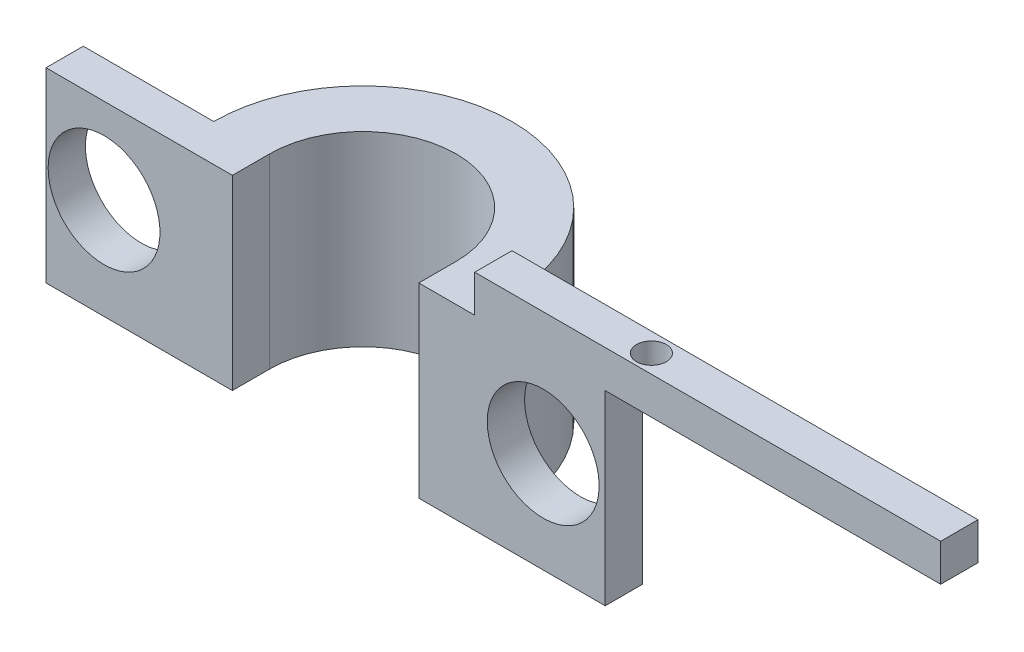
ISO-10303-21;
HEADER;
FILE_DESCRIPTION(('STEP AP214'),'2;1');
FILE_NAME('part.step','',(''),(''),'','','');
FILE_SCHEMA(('AUTOMOTIVE_DESIGN { 1 0 10303 214 1 1 1 1 }'));
ENDSEC;
DATA;
#1=APPLICATION_CONTEXT('core data for automotive mechanical design processes');
#2=APPLICATION_PROTOCOL_DEFINITION('international standard','automotive_design',2000,#1);
#3=PRODUCT_CONTEXT('',#1,'mechanical');
#4=PRODUCT('Part','Part','',(#3));
#5=PRODUCT_RELATED_PRODUCT_CATEGORY('part','',(#4));
#6=PRODUCT_DEFINITION_FORMATION('','',#4);
#7=PRODUCT_DEFINITION_CONTEXT('part definition',#1,'design');
#8=PRODUCT_DEFINITION('design','',#6,#7);
#9=PRODUCT_DEFINITION_SHAPE('','',#8);
#10=(LENGTH_UNIT() NAMED_UNIT(*) SI_UNIT(.MILLI.,.METRE.));
#11=(NAMED_UNIT(*) PLANE_ANGLE_UNIT() SI_UNIT($,.RADIAN.));
#12=(NAMED_UNIT(*) SI_UNIT($,.STERADIAN.) SOLID_ANGLE_UNIT());
#13=UNCERTAINTY_MEASURE_WITH_UNIT(LENGTH_MEASURE(1.E-05),#10,'distance_accuracy_value','');
#14=(GEOMETRIC_REPRESENTATION_CONTEXT(3) GLOBAL_UNCERTAINTY_ASSIGNED_CONTEXT((#13)) GLOBAL_UNIT_ASSIGNED_CONTEXT((#10,
#11,#12)) REPRESENTATION_CONTEXT('',''));
#15=CARTESIAN_POINT('',(0.,0.,0.));
#16=DIRECTION('',(0.,0.,1.));
#17=DIRECTION('',(1.,0.,0.));
#18=AXIS2_PLACEMENT_3D('',#15,#16,#17);
#19=CARTESIAN_POINT('',(0.,10.,0.));
#20=DIRECTION('',(0.,1.,0.));
#21=DIRECTION('',(0.,0.,1.));
#22=AXIS2_PLACEMENT_3D('',#19,#20,#21);
#23=PLANE('',#22);
#24=DIRECTION('',(0.,0.,1.));
#25=VECTOR('',#24,1.);
#26=CARTESIAN_POINT('',(8.,10.,0.));
#27=LINE('',#26,#25);
#28=CARTESIAN_POINT('',(8.,10.,0.));
#29=VERTEX_POINT('',#28);
#30=CARTESIAN_POINT('',(8.,10.,2.));
#31=VERTEX_POINT('',#30);
#32=EDGE_CURVE('E77',#29,#31,#27,.T.);
#33=ORIENTED_EDGE('',*,*,#32,.F.);
#34=CARTESIAN_POINT('',(0.,10.,0.));
#35=DIRECTION('',(0.,1.,0.));
#36=DIRECTION('',(1.,0.,0.));
#37=AXIS2_PLACEMENT_3D('',#34,#35,#36);
#38=CIRCLE('',#37,8.);
#39=CARTESIAN_POINT('',(-8.,10.,0.));
#40=VERTEX_POINT('',#39);
#41=EDGE_CURVE('E476',#29,#40,#38,.T.);
#42=ORIENTED_EDGE('',*,*,#41,.T.);
#43=DIRECTION('',(-1.,0.,0.));
#44=VECTOR('',#43,1.);
#45=CARTESIAN_POINT('',(-5.,10.,0.));
#46=LINE('',#45,#44);
#47=CARTESIAN_POINT('',(-15.,10.,0.));
#48=VERTEX_POINT('',#47);
#49=EDGE_CURVE('E212',#40,#48,#46,.T.);
#50=ORIENTED_EDGE('',*,*,#49,.T.);
#51=DIRECTION('',(0.,0.,-1.));
#52=VECTOR('',#51,1.);
#53=CARTESIAN_POINT('',(-15.,10.,2.));
#54=LINE('',#53,#52);
#55=CARTESIAN_POINT('',(-15.,10.,2.));
#56=VERTEX_POINT('',#55);
#57=EDGE_CURVE('E232',#56,#48,#54,.T.);
#58=ORIENTED_EDGE('',*,*,#57,.F.);
#59=DIRECTION('',(-1.,0.,0.));
#60=VECTOR('',#59,1.);
#61=CARTESIAN_POINT('',(-5.,10.,2.));
#62=LINE('',#61,#60);
#63=CARTESIAN_POINT('',(-5.,10.,2.));
#64=VERTEX_POINT('',#63);
#65=EDGE_CURVE('E218',#64,#56,#62,.T.);
#66=ORIENTED_EDGE('',*,*,#65,.F.);
#67=DIRECTION('',(0.,0.,-1.));
#68=VECTOR('',#67,1.);
#69=CARTESIAN_POINT('',(-5.,10.,2.));
#70=LINE('',#69,#68);
#71=CARTESIAN_POINT('',(-5.,10.,0.));
#72=VERTEX_POINT('',#71);
#73=EDGE_CURVE('E235',#64,#72,#70,.T.);
#74=ORIENTED_EDGE('',*,*,#73,.T.);
#75=CARTESIAN_POINT('',(0.,10.,0.));
#76=DIRECTION('',(0.,1.,0.));
#77=DIRECTION('',(0.,0.,1.));
#78=AXIS2_PLACEMENT_3D('',#75,#76,#77);
#79=CIRCLE('',#78,5.);
#80=CARTESIAN_POINT('',(5.,10.,0.));
#81=VERTEX_POINT('',#80);
#82=EDGE_CURVE('E103',#81,#72,#79,.T.);
#83=ORIENTED_EDGE('',*,*,#82,.F.);
#84=DIRECTION('',(0.,0.,-1.));
#85=VECTOR('',#84,1.);
#86=CARTESIAN_POINT('',(5.,10.,2.));
#87=LINE('',#86,#85);
#88=CARTESIAN_POINT('',(5.,10.,2.));
#89=VERTEX_POINT('',#88);
#90=EDGE_CURVE('E244',#89,#81,#87,.T.);
#91=ORIENTED_EDGE('',*,*,#90,.F.);
#92=DIRECTION('',(-1.,0.,0.));
#93=VECTOR('',#92,1.);
#94=CARTESIAN_POINT('',(5.,10.,2.));
#95=LINE('',#94,#93);
#96=EDGE_CURVE('E85',#31,#89,#95,.T.);
#97=ORIENTED_EDGE('',*,*,#96,.F.);
#98=EDGE_LOOP('',(#33,#42,#50,#58,#66,#74,#83,#91,#97));
#99=FACE_BOUND('',#98,.T.);
#100=ADVANCED_FACE('F39',(#99),#23,.T.);
#101=CARTESIAN_POINT('',(0.,0.,0.));
#102=DIRECTION('',(0.,1.,0.));
#103=DIRECTION('',(0.,0.,1.));
#104=AXIS2_PLACEMENT_3D('',#101,#102,#103);
#105=PLANE('',#104);
#106=CARTESIAN_POINT('',(0.,0.,0.));
#107=DIRECTION('',(0.,1.,0.));
#108=DIRECTION('',(1.,0.,0.));
#109=AXIS2_PLACEMENT_3D('',#106,#107,#108);
#110=CIRCLE('',#109,8.);
#111=CARTESIAN_POINT('',(8.,0.,0.));
#112=VERTEX_POINT('',#111);
#113=CARTESIAN_POINT('',(-8.,0.,0.));
#114=VERTEX_POINT('',#113);
#115=EDGE_CURVE('E481',#112,#114,#110,.T.);
#116=ORIENTED_EDGE('',*,*,#115,.F.);
#117=DIRECTION('',(1.,0.,0.));
#118=VECTOR('',#117,1.);
#119=CARTESIAN_POINT('',(5.,0.,0.));
#120=LINE('',#119,#118);
#121=CARTESIAN_POINT('',(15.,0.,0.));
#122=VERTEX_POINT('',#121);
#123=EDGE_CURVE('E237',#112,#122,#120,.T.);
#124=ORIENTED_EDGE('',*,*,#123,.T.);
#125=DIRECTION('',(0.,0.,-1.));
#126=VECTOR('',#125,1.);
#127=CARTESIAN_POINT('',(15.,0.,2.));
#128=LINE('',#127,#126);
#129=CARTESIAN_POINT('',(15.,0.,2.));
#130=VERTEX_POINT('',#129);
#131=EDGE_CURVE('E250',#130,#122,#128,.T.);
#132=ORIENTED_EDGE('',*,*,#131,.F.);
#133=DIRECTION('',(1.,0.,0.));
#134=VECTOR('',#133,1.);
#135=CARTESIAN_POINT('',(5.,0.,2.));
#136=LINE('',#135,#134);
#137=CARTESIAN_POINT('',(5.,0.,2.));
#138=VERTEX_POINT('',#137);
#139=EDGE_CURVE('E108',#138,#130,#136,.T.);
#140=ORIENTED_EDGE('',*,*,#139,.F.);
#141=DIRECTION('',(0.,0.,-1.));
#142=VECTOR('',#141,1.);
#143=CARTESIAN_POINT('',(5.,0.,2.));
#144=LINE('',#143,#142);
#145=CARTESIAN_POINT('',(5.,0.,0.));
#146=VERTEX_POINT('',#145);
#147=EDGE_CURVE('E483',#138,#146,#144,.T.);
#148=ORIENTED_EDGE('',*,*,#147,.T.);
#149=CARTESIAN_POINT('',(0.,0.,0.));
#150=DIRECTION('',(0.,1.,0.));
#151=DIRECTION('',(0.,0.,1.));
#152=AXIS2_PLACEMENT_3D('',#149,#150,#151);
#153=CIRCLE('',#152,5.);
#154=CARTESIAN_POINT('',(-5.,0.,0.));
#155=VERTEX_POINT('',#154);
#156=EDGE_CURVE('E56',#146,#155,#153,.T.);
#157=ORIENTED_EDGE('',*,*,#156,.T.);
#158=DIRECTION('',(0.,0.,-1.));
#159=VECTOR('',#158,1.);
#160=CARTESIAN_POINT('',(-5.,0.,2.));
#161=LINE('',#160,#159);
#162=CARTESIAN_POINT('',(-5.,0.,2.));
#163=VERTEX_POINT('',#162);
#164=EDGE_CURVE('E224',#163,#155,#161,.T.);
#165=ORIENTED_EDGE('',*,*,#164,.F.);
#166=DIRECTION('',(1.,0.,0.));
#167=VECTOR('',#166,1.);
#168=CARTESIAN_POINT('',(-5.,0.,2.));
#169=LINE('',#168,#167);
#170=CARTESIAN_POINT('',(-15.,0.,2.));
#171=VERTEX_POINT('',#170);
#172=EDGE_CURVE('E222',#171,#163,#169,.T.);
#173=ORIENTED_EDGE('',*,*,#172,.F.);
#174=DIRECTION('',(0.,0.,-1.));
#175=VECTOR('',#174,1.);
#176=CARTESIAN_POINT('',(-15.,0.,2.));
#177=LINE('',#176,#175);
#178=CARTESIAN_POINT('',(-15.,0.,0.));
#179=VERTEX_POINT('',#178);
#180=EDGE_CURVE('E230',#171,#179,#177,.T.);
#181=ORIENTED_EDGE('',*,*,#180,.T.);
#182=DIRECTION('',(1.,0.,0.));
#183=VECTOR('',#182,1.);
#184=CARTESIAN_POINT('',(-5.,0.,0.));
#185=LINE('',#184,#183);
#186=EDGE_CURVE('E65',#179,#114,#185,.T.);
#187=ORIENTED_EDGE('',*,*,#186,.T.);
#188=EDGE_LOOP('',(#116,#124,#132,#140,#148,#157,#165,#173,#181,#187));
#189=FACE_BOUND('',#188,.T.);
#190=ADVANCED_FACE('F300',(#189),#105,.F.);
#191=CARTESIAN_POINT('',(0.,10.,0.));
#192=DIRECTION('',(0.,-1.,0.));
#193=DIRECTION('',(0.,0.,-1.));
#194=AXIS2_PLACEMENT_3D('',#191,#192,#193);
#195=CYLINDRICAL_SURFACE('',#194,8.);
#196=ORIENTED_EDGE('',*,*,#41,.F.);
#197=DIRECTION('',(0.,1.,0.));
#198=VECTOR('',#197,1.);
#199=CARTESIAN_POINT('',(8.,0.,0.));
#200=LINE('',#199,#198);
#201=EDGE_CURVE('E479',#112,#29,#200,.T.);
#202=ORIENTED_EDGE('',*,*,#201,.F.);
#203=ORIENTED_EDGE('',*,*,#115,.T.);
#204=DIRECTION('',(0.,1.,0.));
#205=VECTOR('',#204,1.);
#206=CARTESIAN_POINT('',(-8.,0.,0.));
#207=LINE('',#206,#205);
#208=EDGE_CURVE('E480',#114,#40,#207,.T.);
#209=ORIENTED_EDGE('',*,*,#208,.T.);
#210=EDGE_LOOP('',(#196,#202,#203,#209));
#211=FACE_BOUND('',#210,.T.);
#212=ADVANCED_FACE('F41',(#211),#195,.T.);
#213=CARTESIAN_POINT('',(0.,10.,0.));
#214=DIRECTION('',(0.,-1.,0.));
#215=DIRECTION('',(0.,0.,-1.));
#216=AXIS2_PLACEMENT_3D('',#213,#214,#215);
#217=CYLINDRICAL_SURFACE('',#216,5.);
#218=DIRECTION('',(0.,-1.,0.));
#219=VECTOR('',#218,1.);
#220=CARTESIAN_POINT('',(5.,10.,0.));
#221=LINE('',#220,#219);
#222=EDGE_CURVE('E12',#81,#146,#221,.T.);
#223=ORIENTED_EDGE('',*,*,#222,.F.);
#224=ORIENTED_EDGE('',*,*,#82,.T.);
#225=DIRECTION('',(0.,-1.,0.));
#226=VECTOR('',#225,1.);
#227=CARTESIAN_POINT('',(-5.,10.,0.));
#228=LINE('',#227,#226);
#229=EDGE_CURVE('E48',#155,#72,#228,.F.);
#230=ORIENTED_EDGE('',*,*,#229,.F.);
#231=ORIENTED_EDGE('',*,*,#156,.F.);
#232=EDGE_LOOP('',(#223,#224,#230,#231));
#233=FACE_BOUND('',#232,.T.);
#234=ADVANCED_FACE('F308',(#233),#217,.F.);
#235=CARTESIAN_POINT('',(0.,0.,0.));
#236=DIRECTION('',(0.,0.,1.));
#237=DIRECTION('',(1.,0.,0.));
#238=AXIS2_PLACEMENT_3D('',#235,#236,#237);
#239=PLANE('',#238);
#240=CARTESIAN_POINT('',(11.6742620763688,5.40681404768861,0.));
#241=DIRECTION('',(0.,0.,-1.));
#242=DIRECTION('',(-1.,0.,0.));
#243=AXIS2_PLACEMENT_3D('',#240,#241,#242);
#244=CIRCLE('',#243,3.);
#245=CARTESIAN_POINT('',(8.67426207636879,5.40681404768861,0.));
#246=VERTEX_POINT('',#245);
#247=EDGE_CURVE('E207',#246,#246,#244,.T.);
#248=ORIENTED_EDGE('',*,*,#247,.F.);
#249=EDGE_LOOP('',(#248));
#250=FACE_BOUND('',#249,.T.);
#251=ORIENTED_EDGE('',*,*,#123,.F.);
#252=ORIENTED_EDGE('',*,*,#201,.T.);
#253=DIRECTION('',(0.,-1.,0.));
#254=VECTOR('',#253,1.);
#255=CARTESIAN_POINT('',(8.,12.,0.));
#256=LINE('',#255,#254);
#257=CARTESIAN_POINT('',(8.,12.,0.));
#258=VERTEX_POINT('',#257);
#259=EDGE_CURVE('E273',#258,#29,#256,.T.);
#260=ORIENTED_EDGE('',*,*,#259,.F.);
#261=DIRECTION('',(-1.,0.,0.));
#262=VECTOR('',#261,1.);
#263=CARTESIAN_POINT('',(8.,12.,0.));
#264=LINE('',#263,#262);
#265=CARTESIAN_POINT('',(33.,12.,0.));
#266=VERTEX_POINT('',#265);
#267=EDGE_CURVE('E170',#266,#258,#264,.T.);
#268=ORIENTED_EDGE('',*,*,#267,.F.);
#269=DIRECTION('',(0.,-1.,0.));
#270=VECTOR('',#269,1.);
#271=CARTESIAN_POINT('',(33.,12.,0.));
#272=LINE('',#271,#270);
#273=CARTESIAN_POINT('',(33.,10.,0.));
#274=VERTEX_POINT('',#273);
#275=EDGE_CURVE('E182',#266,#274,#272,.T.);
#276=ORIENTED_EDGE('',*,*,#275,.T.);
#277=DIRECTION('',(-1.,0.,0.));
#278=VECTOR('',#277,1.);
#279=CARTESIAN_POINT('',(8.,10.,0.));
#280=LINE('',#279,#278);
#281=CARTESIAN_POINT('',(15.,10.,0.));
#282=VERTEX_POINT('',#281);
#283=EDGE_CURVE('E174',#274,#282,#280,.T.);
#284=ORIENTED_EDGE('',*,*,#283,.T.);
#285=DIRECTION('',(0.,1.,0.));
#286=VECTOR('',#285,1.);
#287=CARTESIAN_POINT('',(15.,10.,0.));
#288=LINE('',#287,#286);
#289=EDGE_CURVE('E193',#122,#282,#288,.T.);
#290=ORIENTED_EDGE('',*,*,#289,.F.);
#291=EDGE_LOOP('',(#251,#252,#260,#268,#276,#284,#290));
#292=FACE_BOUND('',#291,.T.);
#293=ADVANCED_FACE('F272',(#250,#292),#239,.F.);
#294=CARTESIAN_POINT('',(5.,10.,2.));
#295=DIRECTION('',(1.,0.,0.));
#296=DIRECTION('',(0.,0.,-1.));
#297=AXIS2_PLACEMENT_3D('',#294,#295,#296);
#298=PLANE('',#297);
#299=ORIENTED_EDGE('',*,*,#222,.T.);
#300=ORIENTED_EDGE('',*,*,#147,.F.);
#301=DIRECTION('',(0.,-1.,0.));
#302=VECTOR('',#301,1.);
#303=CARTESIAN_POINT('',(5.,10.,2.));
#304=LINE('',#303,#302);
#305=EDGE_CURVE('E238',#89,#138,#304,.T.);
#306=ORIENTED_EDGE('',*,*,#305,.F.);
#307=ORIENTED_EDGE('',*,*,#90,.T.);
#308=EDGE_LOOP('',(#299,#300,#306,#307));
#309=FACE_BOUND('',#308,.T.);
#310=ADVANCED_FACE('F311',(#309),#298,.F.);
#311=CARTESIAN_POINT('',(15.,10.,2.));
#312=DIRECTION('',(-1.,0.,0.));
#313=DIRECTION('',(0.,-1.,0.));
#314=AXIS2_PLACEMENT_3D('',#311,#312,#313);
#315=PLANE('',#314);
#316=ORIENTED_EDGE('',*,*,#289,.T.);
#317=DIRECTION('',(0.,0.,-1.));
#318=VECTOR('',#317,1.);
#319=CARTESIAN_POINT('',(15.,10.,2.));
#320=LINE('',#319,#318);
#321=CARTESIAN_POINT('',(15.,10.,2.));
#322=VERTEX_POINT('',#321);
#323=EDGE_CURVE('E247',#322,#282,#320,.T.);
#324=ORIENTED_EDGE('',*,*,#323,.F.);
#325=DIRECTION('',(0.,1.,0.));
#326=VECTOR('',#325,1.);
#327=CARTESIAN_POINT('',(15.,10.,2.));
#328=LINE('',#327,#326);
#329=EDGE_CURVE('E240',#130,#322,#328,.T.);
#330=ORIENTED_EDGE('',*,*,#329,.F.);
#331=ORIENTED_EDGE('',*,*,#131,.T.);
#332=EDGE_LOOP('',(#316,#324,#330,#331));
#333=FACE_BOUND('',#332,.T.);
#334=ADVANCED_FACE('F260',(#333),#315,.F.);
#335=CARTESIAN_POINT('',(0.,0.,2.));
#336=DIRECTION('',(0.,0.,1.));
#337=DIRECTION('',(1.,0.,0.));
#338=AXIS2_PLACEMENT_3D('',#335,#336,#337);
#339=PLANE('',#338);
#340=CARTESIAN_POINT('',(11.6742620763688,5.40681404768861,2.));
#341=DIRECTION('',(0.,0.,-1.));
#342=DIRECTION('',(-1.,0.,0.));
#343=AXIS2_PLACEMENT_3D('',#340,#341,#342);
#344=CIRCLE('',#343,3.);
#345=CARTESIAN_POINT('',(8.67426207636879,5.40681404768861,2.));
#346=VERTEX_POINT('',#345);
#347=EDGE_CURVE('E209',#346,#346,#344,.T.);
#348=ORIENTED_EDGE('',*,*,#347,.T.);
#349=EDGE_LOOP('',(#348));
#350=FACE_BOUND('',#349,.T.);
#351=ORIENTED_EDGE('',*,*,#305,.T.);
#352=ORIENTED_EDGE('',*,*,#139,.T.);
#353=ORIENTED_EDGE('',*,*,#329,.T.);
#354=DIRECTION('',(1.,0.,0.));
#355=VECTOR('',#354,1.);
#356=CARTESIAN_POINT('',(8.,10.,2.));
#357=LINE('',#356,#355);
#358=CARTESIAN_POINT('',(33.,10.,2.));
#359=VERTEX_POINT('',#358);
#360=EDGE_CURVE('E191',#322,#359,#357,.T.);
#361=ORIENTED_EDGE('',*,*,#360,.T.);
#362=DIRECTION('',(0.,-1.,0.));
#363=VECTOR('',#362,1.);
#364=CARTESIAN_POINT('',(33.,12.,2.));
#365=LINE('',#364,#363);
#366=CARTESIAN_POINT('',(33.,12.,2.));
#367=VERTEX_POINT('',#366);
#368=EDGE_CURVE('E161',#367,#359,#365,.T.);
#369=ORIENTED_EDGE('',*,*,#368,.F.);
#370=DIRECTION('',(1.,0.,0.));
#371=VECTOR('',#370,1.);
#372=CARTESIAN_POINT('',(8.,12.,2.));
#373=LINE('',#372,#371);
#374=CARTESIAN_POINT('',(8.,12.,2.));
#375=VERTEX_POINT('',#374);
#376=EDGE_CURVE('E155',#375,#367,#373,.T.);
#377=ORIENTED_EDGE('',*,*,#376,.F.);
#378=DIRECTION('',(0.,-1.,0.));
#379=VECTOR('',#378,1.);
#380=CARTESIAN_POINT('',(8.,12.,2.));
#381=LINE('',#380,#379);
#382=EDGE_CURVE('E159',#375,#31,#381,.T.);
#383=ORIENTED_EDGE('',*,*,#382,.T.);
#384=ORIENTED_EDGE('',*,*,#96,.T.);
#385=EDGE_LOOP('',(#351,#352,#353,#361,#369,#377,#383,#384));
#386=FACE_BOUND('',#385,.T.);
#387=ADVANCED_FACE('F157',(#350,#386),#339,.T.);
#388=CARTESIAN_POINT('',(0.,0.,0.));
#389=DIRECTION('',(0.,0.,-1.));
#390=DIRECTION('',(-1.,0.,0.));
#391=AXIS2_PLACEMENT_3D('',#388,#389,#390);
#392=PLANE('',#391);
#393=CARTESIAN_POINT('',(-11.8859313947723,5.40681404768861,0.));
#394=DIRECTION('',(0.,0.,-1.));
#395=DIRECTION('',(-1.,0.,0.));
#396=AXIS2_PLACEMENT_3D('',#393,#394,#395);
#397=CIRCLE('',#396,3.);
#398=CARTESIAN_POINT('',(-14.8859313947723,5.40681404768861,0.));
#399=VERTEX_POINT('',#398);
#400=EDGE_CURVE('E177',#399,#399,#397,.T.);
#401=ORIENTED_EDGE('',*,*,#400,.F.);
#402=EDGE_LOOP('',(#401));
#403=FACE_BOUND('',#402,.T.);
#404=ORIENTED_EDGE('',*,*,#208,.F.);
#405=ORIENTED_EDGE('',*,*,#186,.F.);
#406=DIRECTION('',(0.,-1.,0.));
#407=VECTOR('',#406,1.);
#408=CARTESIAN_POINT('',(-15.,10.,0.));
#409=LINE('',#408,#407);
#410=EDGE_CURVE('E226',#48,#179,#409,.T.);
#411=ORIENTED_EDGE('',*,*,#410,.F.);
#412=ORIENTED_EDGE('',*,*,#49,.F.);
#413=EDGE_LOOP('',(#404,#405,#411,#412));
#414=FACE_BOUND('',#413,.T.);
#415=ADVANCED_FACE('F322',(#403,#414),#392,.T.);
#416=CARTESIAN_POINT('',(-5.,10.,2.));
#417=DIRECTION('',(-1.,0.,0.));
#418=DIRECTION('',(0.,0.,1.));
#419=AXIS2_PLACEMENT_3D('',#416,#417,#418);
#420=PLANE('',#419);
#421=ORIENTED_EDGE('',*,*,#229,.T.);
#422=ORIENTED_EDGE('',*,*,#73,.F.);
#423=DIRECTION('',(0.,1.,0.));
#424=VECTOR('',#423,1.);
#425=CARTESIAN_POINT('',(-5.,10.,2.));
#426=LINE('',#425,#424);
#427=EDGE_CURVE('E215',#163,#64,#426,.T.);
#428=ORIENTED_EDGE('',*,*,#427,.F.);
#429=ORIENTED_EDGE('',*,*,#164,.T.);
#430=EDGE_LOOP('',(#421,#422,#428,#429));
#431=FACE_BOUND('',#430,.T.);
#432=ADVANCED_FACE('F324',(#431),#420,.F.);
#433=CARTESIAN_POINT('',(-15.,10.,2.));
#434=DIRECTION('',(1.,0.,0.));
#435=DIRECTION('',(0.,1.,0.));
#436=AXIS2_PLACEMENT_3D('',#433,#434,#435);
#437=PLANE('',#436);
#438=ORIENTED_EDGE('',*,*,#410,.T.);
#439=ORIENTED_EDGE('',*,*,#180,.F.);
#440=DIRECTION('',(0.,-1.,0.));
#441=VECTOR('',#440,1.);
#442=CARTESIAN_POINT('',(-15.,10.,2.));
#443=LINE('',#442,#441);
#444=EDGE_CURVE('E220',#56,#171,#443,.T.);
#445=ORIENTED_EDGE('',*,*,#444,.F.);
#446=ORIENTED_EDGE('',*,*,#57,.T.);
#447=EDGE_LOOP('',(#438,#439,#445,#446));
#448=FACE_BOUND('',#447,.T.);
#449=ADVANCED_FACE('F327',(#448),#437,.F.);
#450=CARTESIAN_POINT('',(0.,0.,2.));
#451=DIRECTION('',(0.,0.,-1.));
#452=DIRECTION('',(-1.,0.,0.));
#453=AXIS2_PLACEMENT_3D('',#450,#451,#452);
#454=PLANE('',#453);
#455=CARTESIAN_POINT('',(-11.8859313947723,5.40681404768861,2.));
#456=DIRECTION('',(0.,0.,-1.));
#457=DIRECTION('',(-1.,0.,0.));
#458=AXIS2_PLACEMENT_3D('',#455,#456,#457);
#459=CIRCLE('',#458,3.);
#460=CARTESIAN_POINT('',(-14.8859313947723,5.40681404768861,2.));
#461=VERTEX_POINT('',#460);
#462=EDGE_CURVE('E180',#461,#461,#459,.T.);
#463=ORIENTED_EDGE('',*,*,#462,.T.);
#464=EDGE_LOOP('',(#463));
#465=FACE_BOUND('',#464,.T.);
#466=ORIENTED_EDGE('',*,*,#427,.T.);
#467=ORIENTED_EDGE('',*,*,#65,.T.);
#468=ORIENTED_EDGE('',*,*,#444,.T.);
#469=ORIENTED_EDGE('',*,*,#172,.T.);
#470=EDGE_LOOP('',(#466,#467,#468,#469));
#471=FACE_BOUND('',#470,.T.);
#472=ADVANCED_FACE('F331',(#465,#471),#454,.F.);
#473=CARTESIAN_POINT('',(11.6742620763688,5.40681404768861,2.));
#474=DIRECTION('',(0.,0.,-1.));
#475=DIRECTION('',(-1.,0.,0.));
#476=AXIS2_PLACEMENT_3D('',#473,#474,#475);
#477=CYLINDRICAL_SURFACE('',#476,3.);
#478=ORIENTED_EDGE('',*,*,#347,.F.);
#479=EDGE_LOOP('',(#478));
#480=FACE_BOUND('',#479,.T.);
#481=ORIENTED_EDGE('',*,*,#247,.T.);
#482=EDGE_LOOP('',(#481));
#483=FACE_BOUND('',#482,.T.);
#484=ADVANCED_FACE('F338',(#480,#483),#477,.F.);
#485=CARTESIAN_POINT('',(-11.8859313947723,5.40681404768861,2.));
#486=DIRECTION('',(0.,0.,-1.));
#487=DIRECTION('',(-1.,0.,0.));
#488=AXIS2_PLACEMENT_3D('',#485,#486,#487);
#489=CYLINDRICAL_SURFACE('',#488,3.);
#490=ORIENTED_EDGE('',*,*,#462,.F.);
#491=EDGE_LOOP('',(#490));
#492=FACE_BOUND('',#491,.T.);
#493=ORIENTED_EDGE('',*,*,#400,.T.);
#494=EDGE_LOOP('',(#493));
#495=FACE_BOUND('',#494,.T.);
#496=ADVANCED_FACE('F342',(#492,#495),#489,.F.);
#497=CARTESIAN_POINT('',(0.,10.,0.));
#498=DIRECTION('',(0.,1.,0.));
#499=DIRECTION('',(0.,0.,1.));
#500=AXIS2_PLACEMENT_3D('',#497,#498,#499);
#501=PLANE('',#500);
#502=CARTESIAN_POINT('',(16.5,10.,1.02121390600374));
#503=DIRECTION('',(0.,1.,0.));
#504=DIRECTION('',(0.,0.,1.));
#505=AXIS2_PLACEMENT_3D('',#502,#503,#504);
#506=CIRCLE('',#505,0.799999999999999);
#507=CARTESIAN_POINT('',(16.5,10.,1.82121390600374));
#508=VERTEX_POINT('',#507);
#509=EDGE_CURVE('E192',#508,#508,#506,.T.);
#510=ORIENTED_EDGE('',*,*,#509,.T.);
#511=EDGE_LOOP('',(#510));
#512=FACE_BOUND('',#511,.T.);
#513=ORIENTED_EDGE('',*,*,#360,.F.);
#514=ORIENTED_EDGE('',*,*,#323,.T.);
#515=ORIENTED_EDGE('',*,*,#283,.F.);
#516=DIRECTION('',(0.,0.,-1.));
#517=VECTOR('',#516,1.);
#518=CARTESIAN_POINT('',(33.,10.,0.));
#519=LINE('',#518,#517);
#520=EDGE_CURVE('E201',#359,#274,#519,.T.);
#521=ORIENTED_EDGE('',*,*,#520,.F.);
#522=EDGE_LOOP('',(#513,#514,#515,#521));
#523=FACE_BOUND('',#522,.T.);
#524=ADVANCED_FACE('F266',(#512,#523),#501,.F.);
#525=CARTESIAN_POINT('',(8.,12.,0.));
#526=DIRECTION('',(1.,0.,0.));
#527=DIRECTION('',(0.,0.,-1.));
#528=AXIS2_PLACEMENT_3D('',#525,#526,#527);
#529=PLANE('',#528);
#530=ORIENTED_EDGE('',*,*,#32,.T.);
#531=ORIENTED_EDGE('',*,*,#382,.F.);
#532=DIRECTION('',(0.,0.,1.));
#533=VECTOR('',#532,1.);
#534=CARTESIAN_POINT('',(8.,12.,0.));
#535=LINE('',#534,#533);
#536=EDGE_CURVE('E165',#258,#375,#535,.T.);
#537=ORIENTED_EDGE('',*,*,#536,.F.);
#538=ORIENTED_EDGE('',*,*,#259,.T.);
#539=EDGE_LOOP('',(#530,#531,#537,#538));
#540=FACE_BOUND('',#539,.T.);
#541=ADVANCED_FACE('F176',(#540),#529,.F.);
#542=CARTESIAN_POINT('',(33.,12.,0.));
#543=DIRECTION('',(-1.,0.,0.));
#544=DIRECTION('',(0.,0.,1.));
#545=AXIS2_PLACEMENT_3D('',#542,#543,#544);
#546=PLANE('',#545);
#547=ORIENTED_EDGE('',*,*,#520,.T.);
#548=ORIENTED_EDGE('',*,*,#275,.F.);
#549=DIRECTION('',(0.,0.,-1.));
#550=VECTOR('',#549,1.);
#551=CARTESIAN_POINT('',(33.,12.,0.));
#552=LINE('',#551,#550);
#553=EDGE_CURVE('E164',#367,#266,#552,.T.);
#554=ORIENTED_EDGE('',*,*,#553,.F.);
#555=ORIENTED_EDGE('',*,*,#368,.T.);
#556=EDGE_LOOP('',(#547,#548,#554,#555));
#557=FACE_BOUND('',#556,.T.);
#558=ADVANCED_FACE('F292',(#557),#546,.F.);
#559=CARTESIAN_POINT('',(0.,12.,0.));
#560=DIRECTION('',(0.,1.,0.));
#561=DIRECTION('',(0.,0.,1.));
#562=AXIS2_PLACEMENT_3D('',#559,#560,#561);
#563=PLANE('',#562);
#564=CARTESIAN_POINT('',(16.5,12.,1.02121390600374));
#565=DIRECTION('',(0.,1.,0.));
#566=DIRECTION('',(0.,0.,1.));
#567=AXIS2_PLACEMENT_3D('',#564,#565,#566);
#568=CIRCLE('',#567,0.799999999999999);
#569=CARTESIAN_POINT('',(16.5,12.,1.82121390600374));
#570=VERTEX_POINT('',#569);
#571=EDGE_CURVE('E278',#570,#570,#568,.T.);
#572=ORIENTED_EDGE('',*,*,#571,.F.);
#573=EDGE_LOOP('',(#572));
#574=FACE_BOUND('',#573,.T.);
#575=ORIENTED_EDGE('',*,*,#536,.T.);
#576=ORIENTED_EDGE('',*,*,#376,.T.);
#577=ORIENTED_EDGE('',*,*,#553,.T.);
#578=ORIENTED_EDGE('',*,*,#267,.T.);
#579=EDGE_LOOP('',(#575,#576,#577,#578));
#580=FACE_BOUND('',#579,.T.);
#581=ADVANCED_FACE('F168',(#574,#580),#563,.T.);
#582=CARTESIAN_POINT('',(16.5,10.,1.02121390600374));
#583=DIRECTION('',(0.,1.,0.));
#584=DIRECTION('',(0.,0.,1.));
#585=AXIS2_PLACEMENT_3D('',#582,#583,#584);
#586=CYLINDRICAL_SURFACE('',#585,0.799999999999999);
#587=ORIENTED_EDGE('',*,*,#509,.F.);
#588=EDGE_LOOP('',(#587));
#589=FACE_BOUND('',#588,.T.);
#590=ORIENTED_EDGE('',*,*,#571,.T.);
#591=EDGE_LOOP('',(#590));
#592=FACE_BOUND('',#591,.T.);
#593=ADVANCED_FACE('F285',(#589,#592),#586,.F.);
#594=CLOSED_SHELL('',(#100,#190,#212,#234,#293,#310,#334,#387,#415,#432,#449,#472,#484,#496,
#524,#541,#558,#581,#593));
#595=MANIFOLD_SOLID_BREP('B2',#594);
#596=ADVANCED_BREP_SHAPE_REPRESENTATION('',(#18,#595),#14);
#597=SHAPE_DEFINITION_REPRESENTATION(#9,#596);
ENDSEC;
END-ISO-10303-21;
